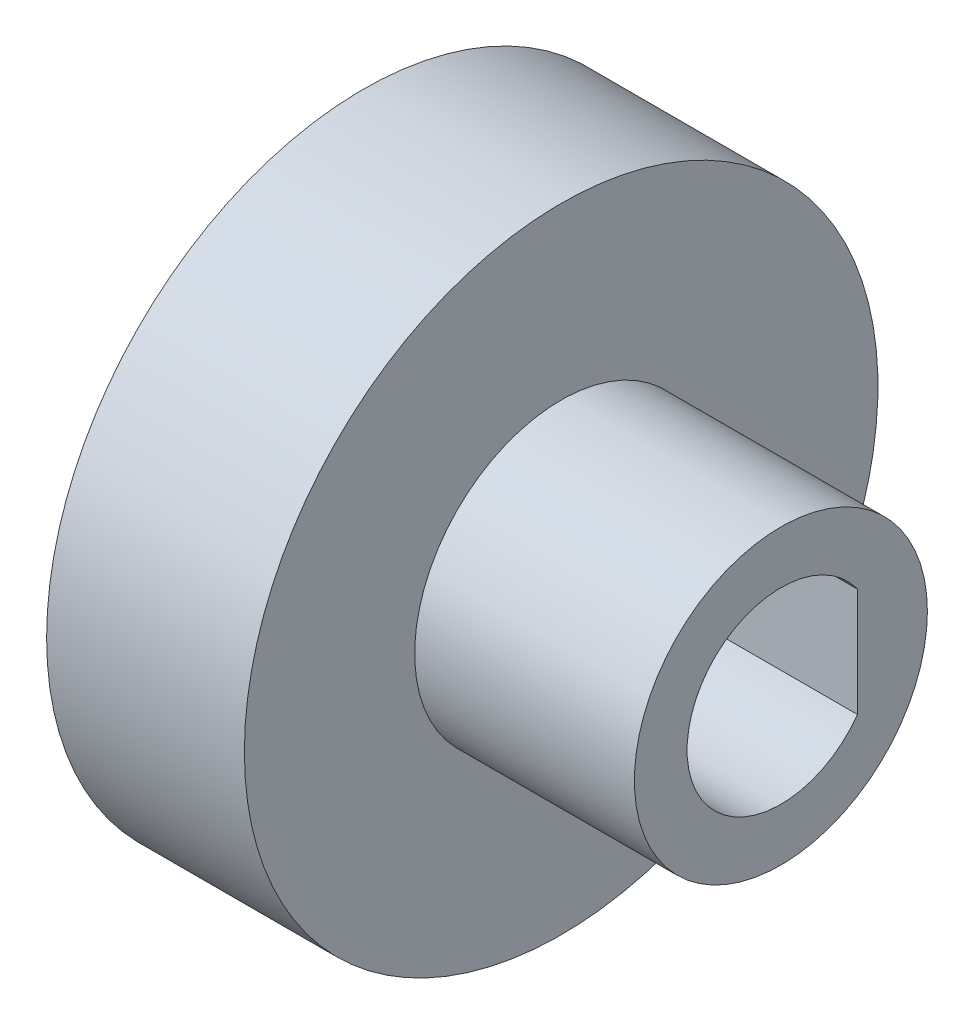
ISO-10303-21;
HEADER;
FILE_DESCRIPTION(('STEP AP214'),'2;1');
FILE_NAME('part.step','',(''),(''),'','','');
FILE_SCHEMA(('AUTOMOTIVE_DESIGN { 1 0 10303 214 1 1 1 1 }'));
ENDSEC;
DATA;
#1=APPLICATION_CONTEXT('core data for automotive mechanical design processes');
#2=APPLICATION_PROTOCOL_DEFINITION('international standard','automotive_design',2000,#1);
#3=PRODUCT_CONTEXT('',#1,'mechanical');
#4=PRODUCT('Part','Part','',(#3));
#5=PRODUCT_RELATED_PRODUCT_CATEGORY('part','',(#4));
#6=PRODUCT_DEFINITION_FORMATION('','',#4);
#7=PRODUCT_DEFINITION_CONTEXT('part definition',#1,'design');
#8=PRODUCT_DEFINITION('design','',#6,#7);
#9=PRODUCT_DEFINITION_SHAPE('','',#8);
#10=(LENGTH_UNIT() NAMED_UNIT(*) SI_UNIT(.MILLI.,.METRE.));
#11=(NAMED_UNIT(*) PLANE_ANGLE_UNIT() SI_UNIT($,.RADIAN.));
#12=(NAMED_UNIT(*) SI_UNIT($,.STERADIAN.) SOLID_ANGLE_UNIT());
#13=UNCERTAINTY_MEASURE_WITH_UNIT(LENGTH_MEASURE(1.E-05),#10,'distance_accuracy_value','');
#14=(GEOMETRIC_REPRESENTATION_CONTEXT(3) GLOBAL_UNCERTAINTY_ASSIGNED_CONTEXT((#13)) GLOBAL_UNIT_ASSIGNED_CONTEXT((#10,
#11,#12)) REPRESENTATION_CONTEXT('',''));
#15=CARTESIAN_POINT('',(0.,0.,0.));
#16=DIRECTION('',(0.,0.,1.));
#17=DIRECTION('',(1.,0.,0.));
#18=AXIS2_PLACEMENT_3D('',#15,#16,#17);
#19=CARTESIAN_POINT('',(7.62,0.,0.));
#20=DIRECTION('',(-1.,0.,0.));
#21=DIRECTION('',(0.,0.,0.999999999999998));
#22=AXIS2_PLACEMENT_3D('',#19,#20,#21);
#23=CYLINDRICAL_SURFACE('',#22,5.08);
#24=CARTESIAN_POINT('',(7.62,0.,0.));
#25=DIRECTION('',(1.,0.,0.));
#26=DIRECTION('',(0.,0.,-0.999999999999998));
#27=AXIS2_PLACEMENT_3D('',#24,#25,#26);
#28=CIRCLE('',#27,5.08);
#29=CARTESIAN_POINT('',(7.62,0.,-5.07999999999999));
#30=VERTEX_POINT('',#29);
#31=EDGE_CURVE('E11',#30,#30,#28,.T.);
#32=ORIENTED_EDGE('',*,*,#31,.F.);
#33=EDGE_LOOP('',(#32));
#34=FACE_BOUND('',#33,.T.);
#35=CARTESIAN_POINT('',(0.,0.,0.));
#36=DIRECTION('',(1.,0.,0.));
#37=DIRECTION('',(0.,0.,-0.999999999999998));
#38=AXIS2_PLACEMENT_3D('',#35,#36,#37);
#39=CIRCLE('',#38,5.08);
#40=CARTESIAN_POINT('',(0.,0.,-5.07999999999999));
#41=VERTEX_POINT('',#40);
#42=EDGE_CURVE('E37',#41,#41,#39,.T.);
#43=ORIENTED_EDGE('',*,*,#42,.T.);
#44=EDGE_LOOP('',(#43));
#45=FACE_BOUND('',#44,.T.);
#46=ADVANCED_FACE('F34',(#34,#45),#23,.T.);
#47=CARTESIAN_POINT('',(7.62,0.,0.));
#48=DIRECTION('',(1.,0.,0.));
#49=DIRECTION('',(0.,0.,-0.999999999999998));
#50=AXIS2_PLACEMENT_3D('',#47,#48,#49);
#51=PLANE('',#50);
#52=CARTESIAN_POINT('',(7.62,0.,0.));
#53=DIRECTION('',(1.,0.,0.));
#54=DIRECTION('',(0.,0.,-0.999999999999998));
#55=AXIS2_PLACEMENT_3D('',#52,#53,#54);
#56=CIRCLE('',#55,3.254);
#57=CARTESIAN_POINT('',(7.62000000000013,-1.88276392572196,-2.65399999999999));
#58=VERTEX_POINT('',#57);
#59=CARTESIAN_POINT('',(7.62000000000013,1.88276392572197,-2.65399999999998));
#60=VERTEX_POINT('',#59);
#61=EDGE_CURVE('E70',#58,#60,#56,.F.);
#62=ORIENTED_EDGE('',*,*,#61,.T.);
#63=DIRECTION('',(0.,-0.999999999999998,0.));
#64=VECTOR('',#63,1.);
#65=CARTESIAN_POINT('',(7.62000000000013,-1.88276392572196,-2.65399999999999));
#66=LINE('',#65,#64);
#67=EDGE_CURVE('E61',#60,#58,#66,.T.);
#68=ORIENTED_EDGE('',*,*,#67,.T.);
#69=EDGE_LOOP('',(#62,#68));
#70=FACE_BOUND('',#69,.T.);
#71=ORIENTED_EDGE('',*,*,#31,.T.);
#72=EDGE_LOOP('',(#71));
#73=FACE_BOUND('',#72,.T.);
#74=ADVANCED_FACE('F73',(#70,#73),#51,.T.);
#75=CARTESIAN_POINT('',(-6.858,0.,0.));
#76=DIRECTION('',(1.,0.,0.));
#77=DIRECTION('',(0.,0.,-0.999999999999998));
#78=AXIS2_PLACEMENT_3D('',#75,#76,#77);
#79=CYLINDRICAL_SURFACE('',#78,10.9855);
#80=CARTESIAN_POINT('',(-6.858,0.,0.));
#81=DIRECTION('',(-1.,0.,0.));
#82=DIRECTION('',(0.,0.,0.999999999999998));
#83=AXIS2_PLACEMENT_3D('',#80,#81,#82);
#84=CIRCLE('',#83,10.9855);
#85=CARTESIAN_POINT('',(-6.858,0.,10.9855));
#86=VERTEX_POINT('',#85);
#87=EDGE_CURVE('E80',#86,#86,#84,.T.);
#88=ORIENTED_EDGE('',*,*,#87,.F.);
#89=EDGE_LOOP('',(#88));
#90=FACE_BOUND('',#89,.T.);
#91=CARTESIAN_POINT('',(0.,0.,0.));
#92=DIRECTION('',(-1.,0.,0.));
#93=DIRECTION('',(0.,0.,0.999999999999998));
#94=AXIS2_PLACEMENT_3D('',#91,#92,#93);
#95=CIRCLE('',#94,10.9855);
#96=CARTESIAN_POINT('',(0.,0.,10.9855));
#97=VERTEX_POINT('',#96);
#98=EDGE_CURVE('E67',#97,#97,#95,.T.);
#99=ORIENTED_EDGE('',*,*,#98,.T.);
#100=EDGE_LOOP('',(#99));
#101=FACE_BOUND('',#100,.T.);
#102=ADVANCED_FACE('F86',(#90,#101),#79,.T.);
#103=CARTESIAN_POINT('',(-6.858,0.,0.));
#104=DIRECTION('',(-1.,0.,0.));
#105=DIRECTION('',(0.,0.,0.999999999999998));
#106=AXIS2_PLACEMENT_3D('',#103,#104,#105);
#107=PLANE('',#106);
#108=CARTESIAN_POINT('',(-6.858,0.,0.));
#109=DIRECTION('',(-1.,0.,0.));
#110=DIRECTION('',(0.,0.,0.999999999999998));
#111=AXIS2_PLACEMENT_3D('',#108,#109,#110);
#112=CIRCLE('',#111,3.254);
#113=CARTESIAN_POINT('',(-6.85799999999988,-1.88276392572196,-2.65399999999999));
#114=VERTEX_POINT('',#113);
#115=CARTESIAN_POINT('',(-6.85799999999988,1.88276392572198,-2.65399999999999));
#116=VERTEX_POINT('',#115);
#117=EDGE_CURVE('E55',#114,#116,#112,.T.);
#118=ORIENTED_EDGE('',*,*,#117,.F.);
#119=DIRECTION('',(0.,-0.999999999999998,0.));
#120=VECTOR('',#119,1.);
#121=CARTESIAN_POINT('',(-6.85799999999988,-1.88276392572196,-2.65399999999999));
#122=LINE('',#121,#120);
#123=EDGE_CURVE('E71',#116,#114,#122,.T.);
#124=ORIENTED_EDGE('',*,*,#123,.F.);
#125=EDGE_LOOP('',(#118,#124));
#126=FACE_BOUND('',#125,.T.);
#127=ORIENTED_EDGE('',*,*,#87,.T.);
#128=EDGE_LOOP('',(#127));
#129=FACE_BOUND('',#128,.T.);
#130=ADVANCED_FACE('F90',(#126,#129),#107,.T.);
#131=CARTESIAN_POINT('',(0.,0.,0.));
#132=DIRECTION('',(-1.,0.,0.));
#133=DIRECTION('',(0.,0.,0.999999999999998));
#134=AXIS2_PLACEMENT_3D('',#131,#132,#133);
#135=PLANE('',#134);
#136=ORIENTED_EDGE('',*,*,#42,.F.);
#137=EDGE_LOOP('',(#136));
#138=FACE_BOUND('',#137,.T.);
#139=ORIENTED_EDGE('',*,*,#98,.F.);
#140=EDGE_LOOP('',(#139));
#141=FACE_BOUND('',#140,.T.);
#142=ADVANCED_FACE('F88',(#138,#141),#135,.F.);
#143=CARTESIAN_POINT('',(7.621,0.,0.));
#144=DIRECTION('',(-1.,0.,0.));
#145=DIRECTION('',(0.,0.,0.999999999999998));
#146=AXIS2_PLACEMENT_3D('',#143,#144,#145);
#147=CYLINDRICAL_SURFACE('',#146,3.254);
#148=DIRECTION('',(-1.,0.,0.));
#149=VECTOR('',#148,1.);
#150=CARTESIAN_POINT('',(7.62100000000013,-1.88276392572196,-2.65399999999999));
#151=LINE('',#150,#149);
#152=EDGE_CURVE('E48',#58,#114,#151,.T.);
#153=ORIENTED_EDGE('',*,*,#152,.T.);
#154=ORIENTED_EDGE('',*,*,#117,.T.);
#155=DIRECTION('',(-1.,0.,0.));
#156=VECTOR('',#155,1.);
#157=CARTESIAN_POINT('',(7.62100000000013,1.88276392572197,-2.65399999999998));
#158=LINE('',#157,#156);
#159=EDGE_CURVE('E63',#60,#116,#158,.T.);
#160=ORIENTED_EDGE('',*,*,#159,.F.);
#161=ORIENTED_EDGE('',*,*,#61,.F.);
#162=EDGE_LOOP('',(#153,#154,#160,#161));
#163=FACE_BOUND('',#162,.T.);
#164=ADVANCED_FACE('F69',(#163),#147,.F.);
#165=CARTESIAN_POINT('',(7.62100000000013,-1.88276392572196,-2.65399999999999));
#166=DIRECTION('',(0.,0.,-0.999999999999998));
#167=DIRECTION('',(-1.,0.,0.));
#168=AXIS2_PLACEMENT_3D('',#165,#166,#167);
#169=PLANE('',#168);
#170=ORIENTED_EDGE('',*,*,#159,.T.);
#171=ORIENTED_EDGE('',*,*,#123,.T.);
#172=ORIENTED_EDGE('',*,*,#152,.F.);
#173=ORIENTED_EDGE('',*,*,#67,.F.);
#174=EDGE_LOOP('',(#170,#171,#172,#173));
#175=FACE_BOUND('',#174,.T.);
#176=ADVANCED_FACE('F62',(#175),#169,.F.);
#177=CLOSED_SHELL('',(#46,#74,#102,#130,#142,#164,#176));
#178=MANIFOLD_SOLID_BREP('B2',#177);
#179=ADVANCED_BREP_SHAPE_REPRESENTATION('',(#18,#178),#14);
#180=SHAPE_DEFINITION_REPRESENTATION(#9,#179);
ENDSEC;
END-ISO-10303-21;
